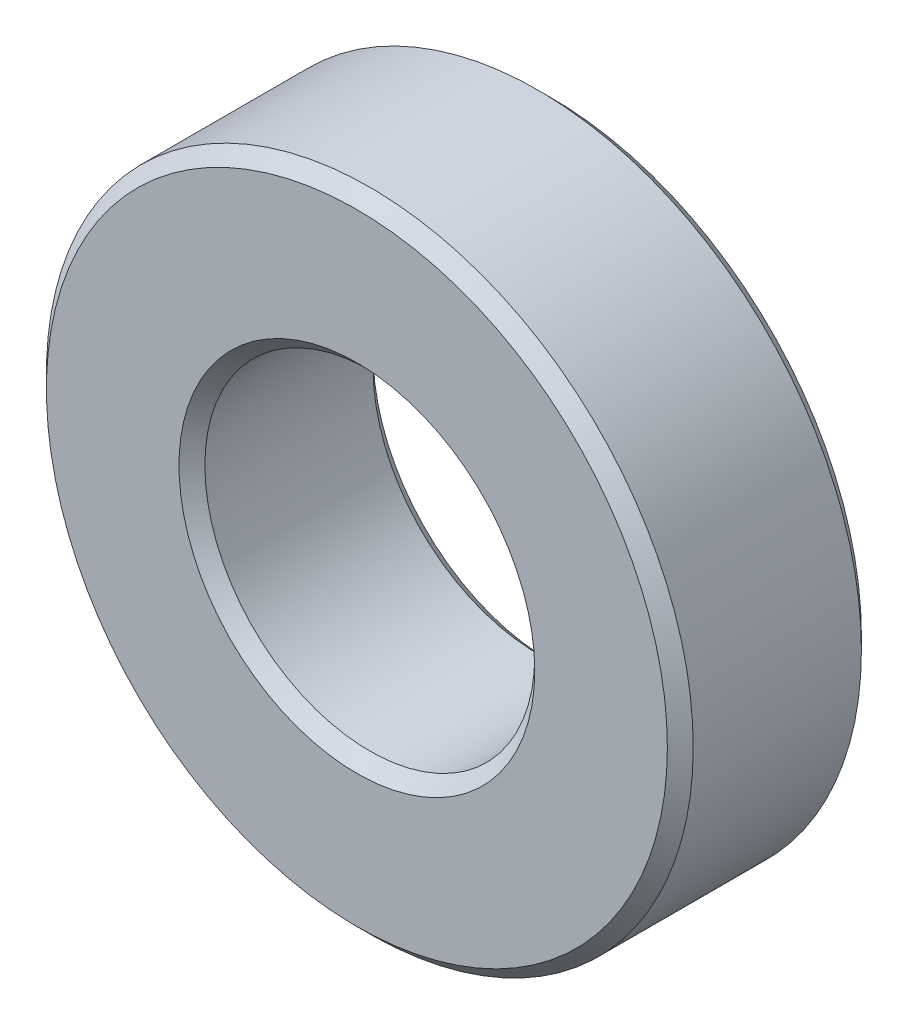
ISO-10303-21;
HEADER;
FILE_DESCRIPTION(('STEP AP214'),'2;1');
FILE_NAME('part.step','',(''),(''),'','','');
FILE_SCHEMA(('AUTOMOTIVE_DESIGN { 1 0 10303 214 1 1 1 1 }'));
ENDSEC;
DATA;
#1=APPLICATION_CONTEXT('core data for automotive mechanical design processes');
#2=APPLICATION_PROTOCOL_DEFINITION('international standard','automotive_design',2000,#1);
#3=PRODUCT_CONTEXT('',#1,'mechanical');
#4=PRODUCT('Part','Part','',(#3));
#5=PRODUCT_RELATED_PRODUCT_CATEGORY('part','',(#4));
#6=PRODUCT_DEFINITION_FORMATION('','',#4);
#7=PRODUCT_DEFINITION_CONTEXT('part definition',#1,'design');
#8=PRODUCT_DEFINITION('design','',#6,#7);
#9=PRODUCT_DEFINITION_SHAPE('','',#8);
#10=(LENGTH_UNIT() NAMED_UNIT(*) SI_UNIT(.MILLI.,.METRE.));
#11=(NAMED_UNIT(*) PLANE_ANGLE_UNIT() SI_UNIT($,.RADIAN.));
#12=(NAMED_UNIT(*) SI_UNIT($,.STERADIAN.) SOLID_ANGLE_UNIT());
#13=UNCERTAINTY_MEASURE_WITH_UNIT(LENGTH_MEASURE(1.E-05),#10,'distance_accuracy_value','');
#14=(GEOMETRIC_REPRESENTATION_CONTEXT(3) GLOBAL_UNCERTAINTY_ASSIGNED_CONTEXT((#13)) GLOBAL_UNIT_ASSIGNED_CONTEXT((#10,
#11,#12)) REPRESENTATION_CONTEXT('',''));
#15=CARTESIAN_POINT('',(0.,0.,0.));
#16=DIRECTION('',(0.,0.,1.));
#17=DIRECTION('',(1.,0.,0.));
#18=AXIS2_PLACEMENT_3D('',#15,#16,#17);
#19=CARTESIAN_POINT('',(0.,0.,3.));
#20=DIRECTION('',(0.,0.,1.));
#21=DIRECTION('',(1.,0.,0.));
#22=AXIS2_PLACEMENT_3D('',#19,#20,#21);
#23=PLANE('',#22);
#24=CARTESIAN_POINT('',(0.,0.,3.));
#25=DIRECTION('',(0.,0.,1.));
#26=DIRECTION('',(1.,0.,0.));
#27=AXIS2_PLACEMENT_3D('',#24,#25,#26);
#28=CIRCLE('',#27,2.75);
#29=CARTESIAN_POINT('',(2.75,0.,3.));
#30=VERTEX_POINT('',#29);
#31=EDGE_CURVE('E10',#30,#30,#28,.F.);
#32=ORIENTED_EDGE('',*,*,#31,.T.);
#33=EDGE_LOOP('',(#32));
#34=FACE_BOUND('',#33,.T.);
#35=CARTESIAN_POINT('',(0.,0.,3.));
#36=DIRECTION('',(0.,0.,1.));
#37=DIRECTION('',(1.,0.,0.));
#38=AXIS2_PLACEMENT_3D('',#35,#36,#37);
#39=CIRCLE('',#38,4.8);
#40=CARTESIAN_POINT('',(4.8,0.,3.));
#41=VERTEX_POINT('',#40);
#42=EDGE_CURVE('E39',#41,#41,#39,.T.);
#43=ORIENTED_EDGE('',*,*,#42,.T.);
#44=EDGE_LOOP('',(#43));
#45=FACE_BOUND('',#44,.T.);
#46=ADVANCED_FACE('F32',(#34,#45),#23,.T.);
#47=CARTESIAN_POINT('',(0.,0.,0.));
#48=DIRECTION('',(0.,0.,1.));
#49=DIRECTION('',(1.,0.,0.));
#50=AXIS2_PLACEMENT_3D('',#47,#48,#49);
#51=PLANE('',#50);
#52=CARTESIAN_POINT('',(0.,0.,0.));
#53=DIRECTION('',(0.,0.,1.));
#54=DIRECTION('',(1.,0.,0.));
#55=AXIS2_PLACEMENT_3D('',#52,#53,#54);
#56=CIRCLE('',#55,4.8);
#57=CARTESIAN_POINT('',(4.8,0.,0.));
#58=VERTEX_POINT('',#57);
#59=EDGE_CURVE('E52',#58,#58,#56,.F.);
#60=ORIENTED_EDGE('',*,*,#59,.T.);
#61=EDGE_LOOP('',(#60));
#62=FACE_BOUND('',#61,.T.);
#63=CARTESIAN_POINT('',(0.,0.,0.));
#64=DIRECTION('',(0.,0.,1.));
#65=DIRECTION('',(1.,0.,0.));
#66=AXIS2_PLACEMENT_3D('',#63,#64,#65);
#67=CIRCLE('',#66,2.75);
#68=CARTESIAN_POINT('',(2.75,0.,0.));
#69=VERTEX_POINT('',#68);
#70=EDGE_CURVE('E55',#69,#69,#67,.T.);
#71=ORIENTED_EDGE('',*,*,#70,.T.);
#72=EDGE_LOOP('',(#71));
#73=FACE_BOUND('',#72,.T.);
#74=ADVANCED_FACE('F76',(#62,#73),#51,.F.);
#75=CARTESIAN_POINT('',(0.,0.,3.));
#76=DIRECTION('',(0.,0.,-1.));
#77=DIRECTION('',(-1.,0.,0.));
#78=AXIS2_PLACEMENT_3D('',#75,#76,#77);
#79=CYLINDRICAL_SURFACE('',#78,5.);
#80=CARTESIAN_POINT('',(0.,0.,0.199999999999999));
#81=DIRECTION('',(0.,0.,1.));
#82=DIRECTION('',(1.,0.,0.));
#83=AXIS2_PLACEMENT_3D('',#80,#81,#82);
#84=CIRCLE('',#83,5.);
#85=CARTESIAN_POINT('',(5.,0.,0.199999999999999));
#86=VERTEX_POINT('',#85);
#87=EDGE_CURVE('E58',#86,#86,#84,.T.);
#88=ORIENTED_EDGE('',*,*,#87,.T.);
#89=EDGE_LOOP('',(#88));
#90=FACE_BOUND('',#89,.T.);
#91=CARTESIAN_POINT('',(0.,0.,2.8));
#92=DIRECTION('',(0.,0.,1.));
#93=DIRECTION('',(1.,0.,0.));
#94=AXIS2_PLACEMENT_3D('',#91,#92,#93);
#95=CIRCLE('',#94,5.);
#96=CARTESIAN_POINT('',(5.,0.,2.8));
#97=VERTEX_POINT('',#96);
#98=EDGE_CURVE('E61',#97,#97,#95,.F.);
#99=ORIENTED_EDGE('',*,*,#98,.T.);
#100=EDGE_LOOP('',(#99));
#101=FACE_BOUND('',#100,.T.);
#102=ADVANCED_FACE('F65',(#90,#101),#79,.T.);
#103=CARTESIAN_POINT('',(0.,0.,3.));
#104=DIRECTION('',(0.,0.,-1.));
#105=DIRECTION('',(-1.,0.,0.));
#106=AXIS2_PLACEMENT_3D('',#103,#104,#105);
#107=CYLINDRICAL_SURFACE('',#106,2.55);
#108=CARTESIAN_POINT('',(0.,0.,0.2));
#109=DIRECTION('',(0.,0.,1.));
#110=DIRECTION('',(1.,0.,0.));
#111=AXIS2_PLACEMENT_3D('',#108,#109,#110);
#112=CIRCLE('',#111,2.55);
#113=CARTESIAN_POINT('',(2.55,0.,0.2));
#114=VERTEX_POINT('',#113);
#115=EDGE_CURVE('E43',#114,#114,#112,.F.);
#116=ORIENTED_EDGE('',*,*,#115,.T.);
#117=EDGE_LOOP('',(#116));
#118=FACE_BOUND('',#117,.T.);
#119=CARTESIAN_POINT('',(0.,0.,2.8));
#120=DIRECTION('',(0.,0.,1.));
#121=DIRECTION('',(1.,0.,0.));
#122=AXIS2_PLACEMENT_3D('',#119,#120,#121);
#123=CIRCLE('',#122,2.55);
#124=CARTESIAN_POINT('',(2.55,0.,2.8));
#125=VERTEX_POINT('',#124);
#126=EDGE_CURVE('E47',#125,#125,#123,.T.);
#127=ORIENTED_EDGE('',*,*,#126,.T.);
#128=EDGE_LOOP('',(#127));
#129=FACE_BOUND('',#128,.T.);
#130=ADVANCED_FACE('F84',(#118,#129),#107,.F.);
#131=CARTESIAN_POINT('',(0.,0.,0.199999999999999));
#132=DIRECTION('',(0.,0.,1.));
#133=DIRECTION('',(1.,0.,0.));
#134=AXIS2_PLACEMENT_3D('',#131,#132,#133);
#135=CONICAL_SURFACE('',#134,5.,0.785398163397448);
#136=ORIENTED_EDGE('',*,*,#59,.F.);
#137=EDGE_LOOP('',(#136));
#138=FACE_BOUND('',#137,.T.);
#139=ORIENTED_EDGE('',*,*,#87,.F.);
#140=EDGE_LOOP('',(#139));
#141=FACE_BOUND('',#140,.T.);
#142=ADVANCED_FACE('F89',(#138,#141),#135,.T.);
#143=CARTESIAN_POINT('',(0.,0.,0.));
#144=DIRECTION('',(0.,0.,-1.));
#145=DIRECTION('',(-1.,0.,0.));
#146=AXIS2_PLACEMENT_3D('',#143,#144,#145);
#147=CONICAL_SURFACE('',#146,2.75,0.785398163397445);
#148=ORIENTED_EDGE('',*,*,#115,.F.);
#149=EDGE_LOOP('',(#148));
#150=FACE_BOUND('',#149,.T.);
#151=ORIENTED_EDGE('',*,*,#70,.F.);
#152=EDGE_LOOP('',(#151));
#153=FACE_BOUND('',#152,.T.);
#154=ADVANCED_FACE('F73',(#150,#153),#147,.F.);
#155=CARTESIAN_POINT('',(0.,0.,2.8));
#156=DIRECTION('',(0.,0.,1.));
#157=DIRECTION('',(1.,0.,0.));
#158=AXIS2_PLACEMENT_3D('',#155,#156,#157);
#159=CONICAL_SURFACE('',#158,2.55,0.785398163397449);
#160=ORIENTED_EDGE('',*,*,#31,.F.);
#161=EDGE_LOOP('',(#160));
#162=FACE_BOUND('',#161,.T.);
#163=ORIENTED_EDGE('',*,*,#126,.F.);
#164=EDGE_LOOP('',(#163));
#165=FACE_BOUND('',#164,.T.);
#166=ADVANCED_FACE('F69',(#162,#165),#159,.F.);
#167=CARTESIAN_POINT('',(0.,0.,3.));
#168=DIRECTION('',(0.,0.,-1.));
#169=DIRECTION('',(-1.,0.,0.));
#170=AXIS2_PLACEMENT_3D('',#167,#168,#169);
#171=CONICAL_SURFACE('',#170,4.8,0.785398163397446);
#172=ORIENTED_EDGE('',*,*,#98,.F.);
#173=EDGE_LOOP('',(#172));
#174=FACE_BOUND('',#173,.T.);
#175=ORIENTED_EDGE('',*,*,#42,.F.);
#176=EDGE_LOOP('',(#175));
#177=FACE_BOUND('',#176,.T.);
#178=ADVANCED_FACE('F34',(#174,#177),#171,.T.);
#179=CLOSED_SHELL('',(#46,#74,#102,#130,#142,#154,#166,#178));
#180=MANIFOLD_SOLID_BREP('B2',#179);
#181=ADVANCED_BREP_SHAPE_REPRESENTATION('',(#18,#180),#14);
#182=SHAPE_DEFINITION_REPRESENTATION(#9,#181);
ENDSEC;
END-ISO-10303-21;
